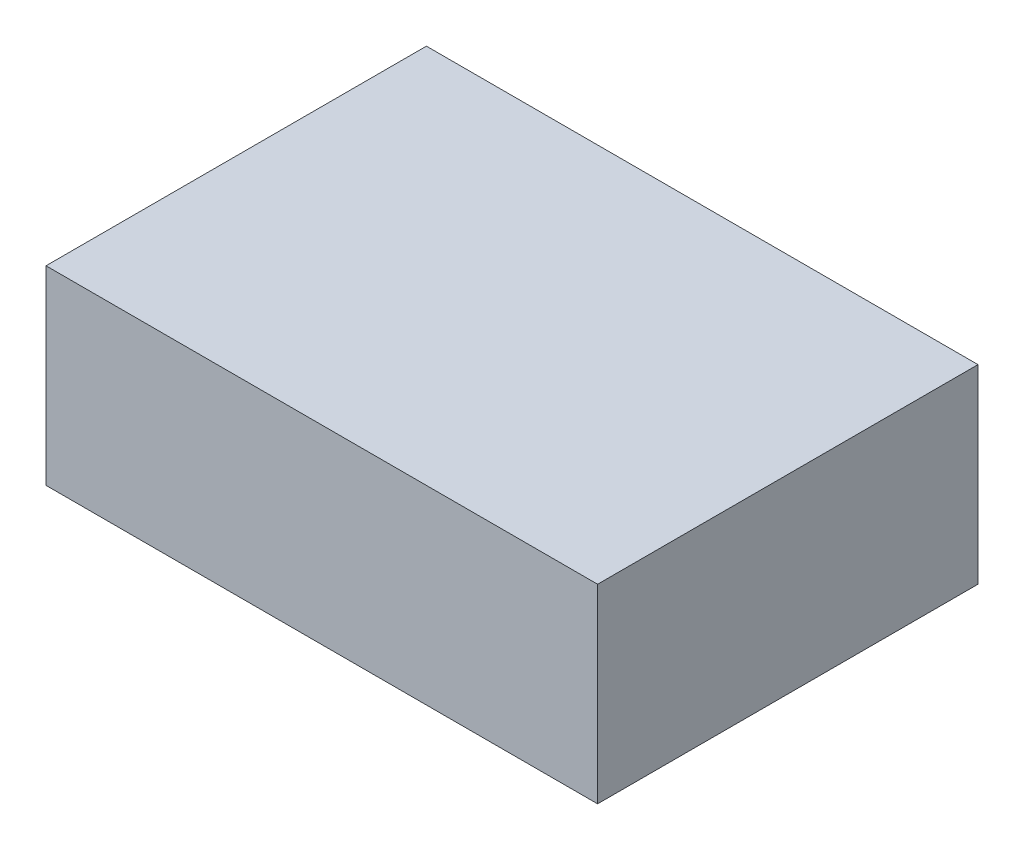
ISO-10303-21;
HEADER;
FILE_DESCRIPTION(('STEP AP214'),'2;1');
FILE_NAME('part.step','',(''),(''),'','','');
FILE_SCHEMA(('AUTOMOTIVE_DESIGN { 1 0 10303 214 1 1 1 1 }'));
ENDSEC;
DATA;
#1=APPLICATION_CONTEXT('core data for automotive mechanical design processes');
#2=APPLICATION_PROTOCOL_DEFINITION('international standard','automotive_design',2000,#1);
#3=PRODUCT_CONTEXT('',#1,'mechanical');
#4=PRODUCT('Part','Part','',(#3));
#5=PRODUCT_RELATED_PRODUCT_CATEGORY('part','',(#4));
#6=PRODUCT_DEFINITION_FORMATION('','',#4);
#7=PRODUCT_DEFINITION_CONTEXT('part definition',#1,'design');
#8=PRODUCT_DEFINITION('design','',#6,#7);
#9=PRODUCT_DEFINITION_SHAPE('','',#8);
#10=(LENGTH_UNIT() NAMED_UNIT(*) SI_UNIT(.MILLI.,.METRE.));
#11=(NAMED_UNIT(*) PLANE_ANGLE_UNIT() SI_UNIT($,.RADIAN.));
#12=(NAMED_UNIT(*) SI_UNIT($,.STERADIAN.) SOLID_ANGLE_UNIT());
#13=UNCERTAINTY_MEASURE_WITH_UNIT(LENGTH_MEASURE(1.E-05),#10,'distance_accuracy_value','');
#14=(GEOMETRIC_REPRESENTATION_CONTEXT(3) GLOBAL_UNCERTAINTY_ASSIGNED_CONTEXT((#13)) GLOBAL_UNIT_ASSIGNED_CONTEXT((#10,
#11,#12)) REPRESENTATION_CONTEXT('',''));
#15=CARTESIAN_POINT('',(0.,0.,0.));
#16=DIRECTION('',(0.,0.,1.));
#17=DIRECTION('',(1.,0.,0.));
#18=AXIS2_PLACEMENT_3D('',#15,#16,#17);
#19=CARTESIAN_POINT('',(0.72499982,0.2499995,0.));
#20=DIRECTION('',(0.,-1.,0.));
#21=DIRECTION('',(-1.,0.,0.));
#22=AXIS2_PLACEMENT_3D('',#19,#20,#21);
#23=PLANE('',#22);
#24=DIRECTION('',(-1.,0.,0.));
#25=VECTOR('',#24,1.);
#26=CARTESIAN_POINT('',(0.72499982,0.2499995,0.));
#27=LINE('',#26,#25);
#28=CARTESIAN_POINT('',(0.72499982,0.2499995,0.));
#29=VERTEX_POINT('',#28);
#30=CARTESIAN_POINT('',(-0.72499982,0.2499995,0.));
#31=VERTEX_POINT('',#30);
#32=EDGE_CURVE('E11',#29,#31,#27,.T.);
#33=ORIENTED_EDGE('',*,*,#32,.T.);
#34=DIRECTION('',(0.,0.,1.));
#35=VECTOR('',#34,1.);
#36=CARTESIAN_POINT('',(-0.72499982,0.2499995,0.));
#37=LINE('',#36,#35);
#38=CARTESIAN_POINT('',(-0.72499982,0.2499995,1.00000054));
#39=VERTEX_POINT('',#38);
#40=EDGE_CURVE('E23',#31,#39,#37,.T.);
#41=ORIENTED_EDGE('',*,*,#40,.T.);
#42=DIRECTION('',(-1.,0.,0.));
#43=VECTOR('',#42,1.);
#44=CARTESIAN_POINT('',(0.72499982,0.2499995,1.00000054));
#45=LINE('',#44,#43);
#46=CARTESIAN_POINT('',(0.72499982,0.2499995,1.00000054));
#47=VERTEX_POINT('',#46);
#48=EDGE_CURVE('E86',#47,#39,#45,.T.);
#49=ORIENTED_EDGE('',*,*,#48,.F.);
#50=DIRECTION('',(0.,0.,1.));
#51=VECTOR('',#50,1.);
#52=CARTESIAN_POINT('',(0.72499982,0.2499995,0.));
#53=LINE('',#52,#51);
#54=EDGE_CURVE('E35',#29,#47,#53,.T.);
#55=ORIENTED_EDGE('',*,*,#54,.F.);
#56=EDGE_LOOP('',(#33,#41,#49,#55));
#57=FACE_BOUND('',#56,.T.);
#58=ADVANCED_FACE('F16',(#57),#23,.F.);
#59=CARTESIAN_POINT('',(-0.72499982,0.2499995,0.));
#60=DIRECTION('',(1.,0.,0.));
#61=DIRECTION('',(0.,-1.,0.));
#62=AXIS2_PLACEMENT_3D('',#59,#60,#61);
#63=PLANE('',#62);
#64=DIRECTION('',(0.,-1.,0.));
#65=VECTOR('',#64,1.);
#66=CARTESIAN_POINT('',(-0.72499982,0.2499995,0.));
#67=LINE('',#66,#65);
#68=CARTESIAN_POINT('',(-0.72499982,-0.2499995,0.));
#69=VERTEX_POINT('',#68);
#70=EDGE_CURVE('E83',#31,#69,#67,.T.);
#71=ORIENTED_EDGE('',*,*,#70,.T.);
#72=DIRECTION('',(0.,0.,1.));
#73=VECTOR('',#72,1.);
#74=CARTESIAN_POINT('',(-0.72499982,-0.2499995,0.));
#75=LINE('',#74,#73);
#76=CARTESIAN_POINT('',(-0.72499982,-0.2499995,1.00000054));
#77=VERTEX_POINT('',#76);
#78=EDGE_CURVE('E81',#69,#77,#75,.T.);
#79=ORIENTED_EDGE('',*,*,#78,.T.);
#80=DIRECTION('',(0.,-1.,0.));
#81=VECTOR('',#80,1.);
#82=CARTESIAN_POINT('',(-0.72499982,0.2499995,1.00000054));
#83=LINE('',#82,#81);
#84=EDGE_CURVE('E61',#39,#77,#83,.T.);
#85=ORIENTED_EDGE('',*,*,#84,.F.);
#86=ORIENTED_EDGE('',*,*,#40,.F.);
#87=EDGE_LOOP('',(#71,#79,#85,#86));
#88=FACE_BOUND('',#87,.T.);
#89=ADVANCED_FACE('F88',(#88),#63,.F.);
#90=CARTESIAN_POINT('',(-0.72499982,-0.2499995,0.));
#91=DIRECTION('',(0.,1.,0.));
#92=DIRECTION('',(1.,0.,0.));
#93=AXIS2_PLACEMENT_3D('',#90,#91,#92);
#94=PLANE('',#93);
#95=DIRECTION('',(1.,0.,0.));
#96=VECTOR('',#95,1.);
#97=CARTESIAN_POINT('',(-0.72499982,-0.2499995,0.));
#98=LINE('',#97,#96);
#99=CARTESIAN_POINT('',(0.72499982,-0.2499995,0.));
#100=VERTEX_POINT('',#99);
#101=EDGE_CURVE('E70',#69,#100,#98,.T.);
#102=ORIENTED_EDGE('',*,*,#101,.T.);
#103=DIRECTION('',(0.,0.,1.));
#104=VECTOR('',#103,1.);
#105=CARTESIAN_POINT('',(0.72499982,-0.2499995,0.));
#106=LINE('',#105,#104);
#107=CARTESIAN_POINT('',(0.72499982,-0.2499995,1.00000054));
#108=VERTEX_POINT('',#107);
#109=EDGE_CURVE('E64',#100,#108,#106,.T.);
#110=ORIENTED_EDGE('',*,*,#109,.T.);
#111=DIRECTION('',(1.,0.,0.));
#112=VECTOR('',#111,1.);
#113=CARTESIAN_POINT('',(-0.72499982,-0.2499995,1.00000054));
#114=LINE('',#113,#112);
#115=EDGE_CURVE('E56',#77,#108,#114,.T.);
#116=ORIENTED_EDGE('',*,*,#115,.F.);
#117=ORIENTED_EDGE('',*,*,#78,.F.);
#118=EDGE_LOOP('',(#102,#110,#116,#117));
#119=FACE_BOUND('',#118,.T.);
#120=ADVANCED_FACE('F68',(#119),#94,.F.);
#121=CARTESIAN_POINT('',(0.72499982,-0.2499995,0.));
#122=DIRECTION('',(-1.,0.,0.));
#123=DIRECTION('',(0.,1.,0.));
#124=AXIS2_PLACEMENT_3D('',#121,#122,#123);
#125=PLANE('',#124);
#126=DIRECTION('',(0.,1.,0.));
#127=VECTOR('',#126,1.);
#128=CARTESIAN_POINT('',(0.72499982,-0.2499995,0.));
#129=LINE('',#128,#127);
#130=EDGE_CURVE('E65',#100,#29,#129,.T.);
#131=ORIENTED_EDGE('',*,*,#130,.T.);
#132=ORIENTED_EDGE('',*,*,#54,.T.);
#133=DIRECTION('',(0.,1.,0.));
#134=VECTOR('',#133,1.);
#135=CARTESIAN_POINT('',(0.72499982,-0.2499995,1.00000054));
#136=LINE('',#135,#134);
#137=EDGE_CURVE('E60',#108,#47,#136,.T.);
#138=ORIENTED_EDGE('',*,*,#137,.F.);
#139=ORIENTED_EDGE('',*,*,#109,.F.);
#140=EDGE_LOOP('',(#131,#132,#138,#139));
#141=FACE_BOUND('',#140,.T.);
#142=ADVANCED_FACE('F75',(#141),#125,.F.);
#143=CARTESIAN_POINT('',(0.72499982,0.2499995,0.));
#144=DIRECTION('',(0.,0.,-1.));
#145=DIRECTION('',(-1.,0.,0.));
#146=AXIS2_PLACEMENT_3D('',#143,#144,#145);
#147=PLANE('',#146);
#148=ORIENTED_EDGE('',*,*,#130,.F.);
#149=ORIENTED_EDGE('',*,*,#101,.F.);
#150=ORIENTED_EDGE('',*,*,#70,.F.);
#151=ORIENTED_EDGE('',*,*,#32,.F.);
#152=EDGE_LOOP('',(#148,#149,#150,#151));
#153=FACE_BOUND('',#152,.T.);
#154=ADVANCED_FACE('F90',(#153),#147,.T.);
#155=CARTESIAN_POINT('',(0.72499982,0.2499995,1.00000054));
#156=DIRECTION('',(0.,0.,-1.));
#157=DIRECTION('',(-1.,0.,0.));
#158=AXIS2_PLACEMENT_3D('',#155,#156,#157);
#159=PLANE('',#158);
#160=ORIENTED_EDGE('',*,*,#48,.T.);
#161=ORIENTED_EDGE('',*,*,#84,.T.);
#162=ORIENTED_EDGE('',*,*,#115,.T.);
#163=ORIENTED_EDGE('',*,*,#137,.T.);
#164=EDGE_LOOP('',(#160,#161,#162,#163));
#165=FACE_BOUND('',#164,.T.);
#166=ADVANCED_FACE('F58',(#165),#159,.F.);
#167=CLOSED_SHELL('',(#58,#89,#120,#142,#154,#166));
#168=MANIFOLD_SOLID_BREP('B1',#167);
#169=ADVANCED_BREP_SHAPE_REPRESENTATION('',(#18,#168),#14);
#170=SHAPE_DEFINITION_REPRESENTATION(#9,#169);
ENDSEC;
END-ISO-10303-21;
